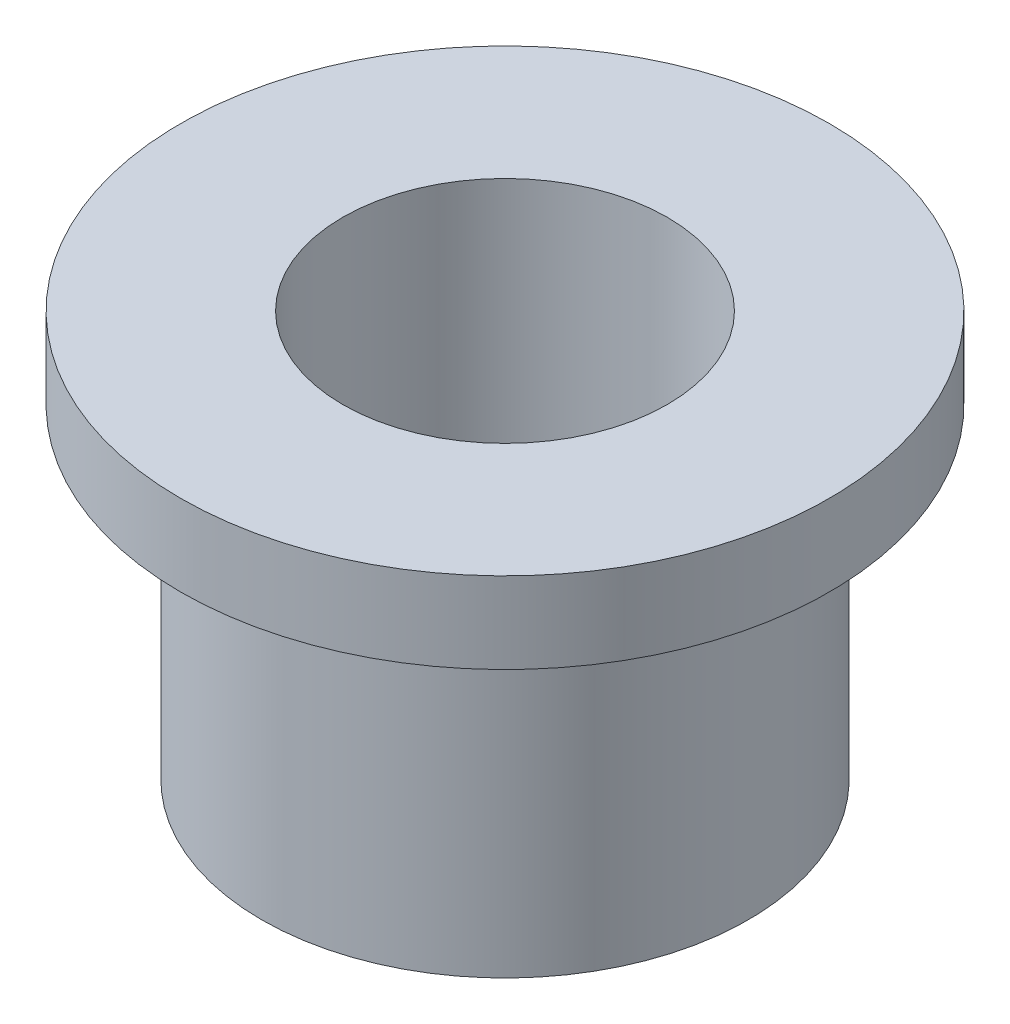
ISO-10303-21;
HEADER;
FILE_DESCRIPTION(('STEP AP214'),'2;1');
FILE_NAME('part.step','',(''),(''),'','','');
FILE_SCHEMA(('AUTOMOTIVE_DESIGN { 1 0 10303 214 1 1 1 1 }'));
ENDSEC;
DATA;
#1=APPLICATION_CONTEXT('core data for automotive mechanical design processes');
#2=APPLICATION_PROTOCOL_DEFINITION('international standard','automotive_design',2000,#1);
#3=PRODUCT_CONTEXT('',#1,'mechanical');
#4=PRODUCT('Part','Part','',(#3));
#5=PRODUCT_RELATED_PRODUCT_CATEGORY('part','',(#4));
#6=PRODUCT_DEFINITION_FORMATION('','',#4);
#7=PRODUCT_DEFINITION_CONTEXT('part definition',#1,'design');
#8=PRODUCT_DEFINITION('design','',#6,#7);
#9=PRODUCT_DEFINITION_SHAPE('','',#8);
#10=(LENGTH_UNIT() NAMED_UNIT(*) SI_UNIT(.MILLI.,.METRE.));
#11=(NAMED_UNIT(*) PLANE_ANGLE_UNIT() SI_UNIT($,.RADIAN.));
#12=(NAMED_UNIT(*) SI_UNIT($,.STERADIAN.) SOLID_ANGLE_UNIT());
#13=UNCERTAINTY_MEASURE_WITH_UNIT(LENGTH_MEASURE(1.E-05),#10,'distance_accuracy_value','');
#14=(GEOMETRIC_REPRESENTATION_CONTEXT(3) GLOBAL_UNCERTAINTY_ASSIGNED_CONTEXT((#13)) GLOBAL_UNIT_ASSIGNED_CONTEXT((#10,
#11,#12)) REPRESENTATION_CONTEXT('',''));
#15=CARTESIAN_POINT('',(0.,0.,0.));
#16=DIRECTION('',(0.,0.,1.));
#17=DIRECTION('',(1.,0.,0.));
#18=AXIS2_PLACEMENT_3D('',#15,#16,#17);
#19=CARTESIAN_POINT('',(0.,0.,0.));
#20=DIRECTION('',(0.,1.,0.));
#21=DIRECTION('',(0.,0.,1.));
#22=AXIS2_PLACEMENT_3D('',#19,#20,#21);
#23=PLANE('',#22);
#24=CARTESIAN_POINT('',(0.,0.,0.));
#25=DIRECTION('',(0.,1.,0.));
#26=DIRECTION('',(0.,0.,1.));
#27=AXIS2_PLACEMENT_3D('',#24,#25,#26);
#28=CIRCLE('',#27,4.7625);
#29=CARTESIAN_POINT('',(0.,0.,4.7625));
#30=VERTEX_POINT('',#29);
#31=EDGE_CURVE('E35',#30,#30,#28,.T.);
#32=ORIENTED_EDGE('',*,*,#31,.F.);
#33=EDGE_LOOP('',(#32));
#34=FACE_BOUND('',#33,.T.);
#35=CARTESIAN_POINT('',(0.,0.,0.));
#36=DIRECTION('',(0.,1.,0.));
#37=DIRECTION('',(0.,0.,1.));
#38=AXIS2_PLACEMENT_3D('',#35,#36,#37);
#39=CIRCLE('',#38,3.175);
#40=CARTESIAN_POINT('',(0.,0.,3.175));
#41=VERTEX_POINT('',#40);
#42=EDGE_CURVE('E42',#41,#41,#39,.T.);
#43=ORIENTED_EDGE('',*,*,#42,.T.);
#44=EDGE_LOOP('',(#43));
#45=FACE_BOUND('',#44,.T.);
#46=ADVANCED_FACE('F31',(#34,#45),#23,.F.);
#47=CARTESIAN_POINT('',(0.,6.35,0.));
#48=DIRECTION('',(0.,-1.,0.));
#49=DIRECTION('',(0.,0.,-1.));
#50=AXIS2_PLACEMENT_3D('',#47,#48,#49);
#51=CYLINDRICAL_SURFACE('',#50,4.7625);
#52=CARTESIAN_POINT('',(0.,6.35,0.));
#53=DIRECTION('',(0.,1.,0.));
#54=DIRECTION('',(0.,0.,1.));
#55=AXIS2_PLACEMENT_3D('',#52,#53,#54);
#56=CIRCLE('',#55,4.7625);
#57=CARTESIAN_POINT('',(0.,6.35,4.7625));
#58=VERTEX_POINT('',#57);
#59=EDGE_CURVE('E10',#58,#58,#56,.T.);
#60=ORIENTED_EDGE('',*,*,#59,.F.);
#61=EDGE_LOOP('',(#60));
#62=FACE_BOUND('',#61,.T.);
#63=ORIENTED_EDGE('',*,*,#31,.T.);
#64=EDGE_LOOP('',(#63));
#65=FACE_BOUND('',#64,.T.);
#66=ADVANCED_FACE('F33',(#62,#65),#51,.T.);
#67=CARTESIAN_POINT('',(0.,6.35,0.));
#68=DIRECTION('',(0.,-1.,0.));
#69=DIRECTION('',(0.,0.,-1.));
#70=AXIS2_PLACEMENT_3D('',#67,#68,#69);
#71=CYLINDRICAL_SURFACE('',#70,3.175);
#72=ORIENTED_EDGE('',*,*,#42,.F.);
#73=EDGE_LOOP('',(#72));
#74=FACE_BOUND('',#73,.T.);
#75=CARTESIAN_POINT('',(0.,7.9375,0.));
#76=DIRECTION('',(0.,1.,0.));
#77=DIRECTION('',(0.,0.,1.));
#78=AXIS2_PLACEMENT_3D('',#75,#76,#77);
#79=CIRCLE('',#78,3.175);
#80=CARTESIAN_POINT('',(0.,7.9375,3.175));
#81=VERTEX_POINT('',#80);
#82=EDGE_CURVE('E50',#81,#81,#79,.T.);
#83=ORIENTED_EDGE('',*,*,#82,.T.);
#84=EDGE_LOOP('',(#83));
#85=FACE_BOUND('',#84,.T.);
#86=ADVANCED_FACE('F56',(#74,#85),#71,.F.);
#87=CARTESIAN_POINT('',(0.,6.35,0.));
#88=DIRECTION('',(0.,1.,0.));
#89=DIRECTION('',(0.,0.,1.));
#90=AXIS2_PLACEMENT_3D('',#87,#88,#89);
#91=PLANE('',#90);
#92=CARTESIAN_POINT('',(0.,6.35,0.));
#93=DIRECTION('',(0.,1.,0.));
#94=DIRECTION('',(0.,0.,1.));
#95=AXIS2_PLACEMENT_3D('',#92,#93,#94);
#96=CIRCLE('',#95,6.35);
#97=CARTESIAN_POINT('',(0.,6.35,6.35));
#98=VERTEX_POINT('',#97);
#99=EDGE_CURVE('E47',#98,#98,#96,.T.);
#100=ORIENTED_EDGE('',*,*,#99,.F.);
#101=EDGE_LOOP('',(#100));
#102=FACE_BOUND('',#101,.T.);
#103=ORIENTED_EDGE('',*,*,#59,.T.);
#104=EDGE_LOOP('',(#103));
#105=FACE_BOUND('',#104,.T.);
#106=ADVANCED_FACE('F61',(#102,#105),#91,.F.);
#107=CARTESIAN_POINT('',(0.,7.9375,0.));
#108=DIRECTION('',(0.,1.,0.));
#109=DIRECTION('',(0.,0.,1.));
#110=AXIS2_PLACEMENT_3D('',#107,#108,#109);
#111=PLANE('',#110);
#112=CARTESIAN_POINT('',(0.,7.9375,0.));
#113=DIRECTION('',(0.,1.,0.));
#114=DIRECTION('',(0.,0.,1.));
#115=AXIS2_PLACEMENT_3D('',#112,#113,#114);
#116=CIRCLE('',#115,6.35);
#117=CARTESIAN_POINT('',(0.,7.9375,6.35));
#118=VERTEX_POINT('',#117);
#119=EDGE_CURVE('E46',#118,#118,#116,.T.);
#120=ORIENTED_EDGE('',*,*,#119,.T.);
#121=EDGE_LOOP('',(#120));
#122=FACE_BOUND('',#121,.T.);
#123=ORIENTED_EDGE('',*,*,#82,.F.);
#124=EDGE_LOOP('',(#123));
#125=FACE_BOUND('',#124,.T.);
#126=ADVANCED_FACE('F58',(#122,#125),#111,.T.);
#127=CARTESIAN_POINT('',(0.,7.9375,0.));
#128=DIRECTION('',(0.,-1.,0.));
#129=DIRECTION('',(0.,0.,-1.));
#130=AXIS2_PLACEMENT_3D('',#127,#128,#129);
#131=CYLINDRICAL_SURFACE('',#130,6.35);
#132=ORIENTED_EDGE('',*,*,#119,.F.);
#133=EDGE_LOOP('',(#132));
#134=FACE_BOUND('',#133,.T.);
#135=ORIENTED_EDGE('',*,*,#99,.T.);
#136=EDGE_LOOP('',(#135));
#137=FACE_BOUND('',#136,.T.);
#138=ADVANCED_FACE('F60',(#134,#137),#131,.T.);
#139=CLOSED_SHELL('',(#46,#66,#86,#106,#126,#138));
#140=MANIFOLD_SOLID_BREP('B2',#139);
#141=ADVANCED_BREP_SHAPE_REPRESENTATION('',(#18,#140),#14);
#142=SHAPE_DEFINITION_REPRESENTATION(#9,#141);
ENDSEC;
END-ISO-10303-21;
